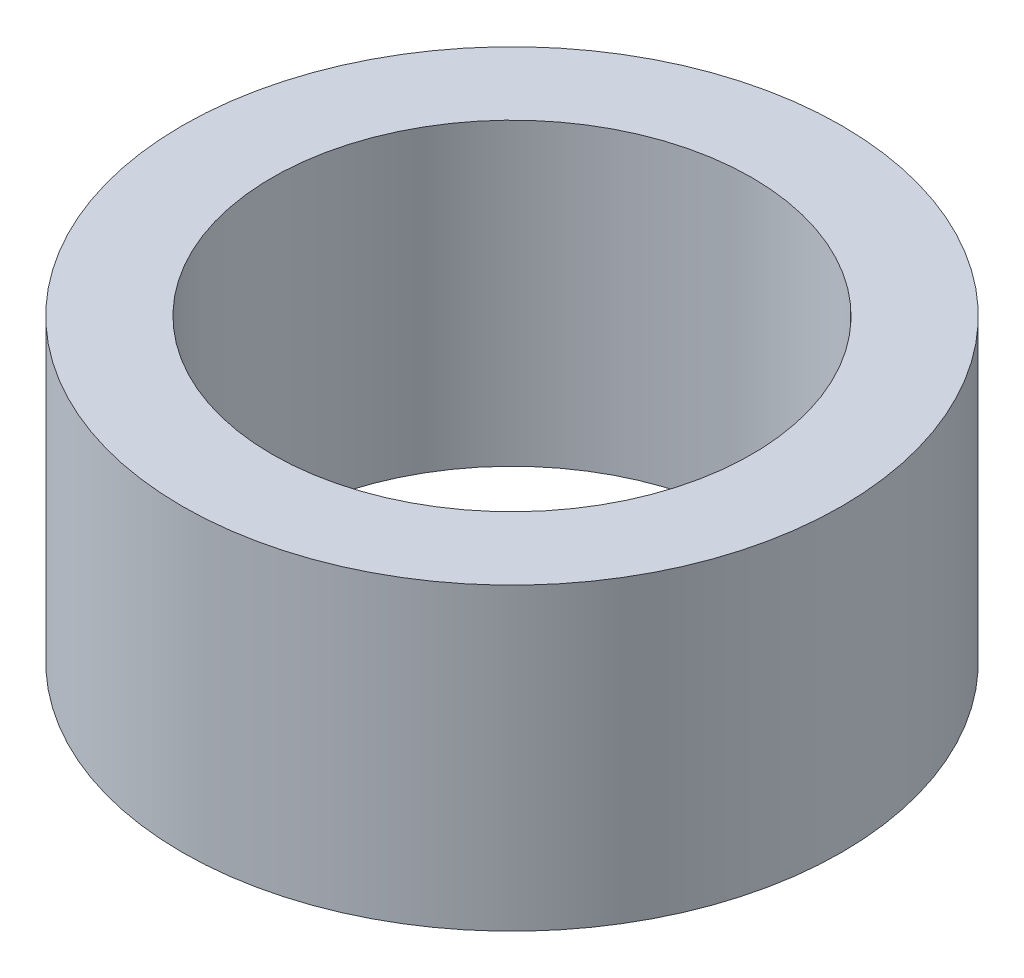
ISO-10303-21;
HEADER;
FILE_DESCRIPTION(('STEP AP214'),'2;1');
FILE_NAME('part.step','',(''),(''),'','','');
FILE_SCHEMA(('AUTOMOTIVE_DESIGN { 1 0 10303 214 1 1 1 1 }'));
ENDSEC;
DATA;
#1=APPLICATION_CONTEXT('core data for automotive mechanical design processes');
#2=APPLICATION_PROTOCOL_DEFINITION('international standard','automotive_design',2000,#1);
#3=PRODUCT_CONTEXT('',#1,'mechanical');
#4=PRODUCT('Part','Part','',(#3));
#5=PRODUCT_RELATED_PRODUCT_CATEGORY('part','',(#4));
#6=PRODUCT_DEFINITION_FORMATION('','',#4);
#7=PRODUCT_DEFINITION_CONTEXT('part definition',#1,'design');
#8=PRODUCT_DEFINITION('design','',#6,#7);
#9=PRODUCT_DEFINITION_SHAPE('','',#8);
#10=(LENGTH_UNIT() NAMED_UNIT(*) SI_UNIT(.MILLI.,.METRE.));
#11=(NAMED_UNIT(*) PLANE_ANGLE_UNIT() SI_UNIT($,.RADIAN.));
#12=(NAMED_UNIT(*) SI_UNIT($,.STERADIAN.) SOLID_ANGLE_UNIT());
#13=UNCERTAINTY_MEASURE_WITH_UNIT(LENGTH_MEASURE(1.E-05),#10,'distance_accuracy_value','');
#14=(GEOMETRIC_REPRESENTATION_CONTEXT(3) GLOBAL_UNCERTAINTY_ASSIGNED_CONTEXT((#13)) GLOBAL_UNIT_ASSIGNED_CONTEXT((#10,
#11,#12)) REPRESENTATION_CONTEXT('',''));
#15=CARTESIAN_POINT('',(0.,0.,0.));
#16=DIRECTION('',(0.,0.,1.));
#17=DIRECTION('',(1.,0.,0.));
#18=AXIS2_PLACEMENT_3D('',#15,#16,#17);
#19=CARTESIAN_POINT('',(0.,2.5,0.));
#20=DIRECTION('',(0.,1.,0.));
#21=DIRECTION('',(0.,0.,1.));
#22=AXIS2_PLACEMENT_3D('',#19,#20,#21);
#23=PLANE('',#22);
#24=CARTESIAN_POINT('',(0.,2.5,0.));
#25=DIRECTION('',(0.,1.,0.));
#26=DIRECTION('',(0.,0.,1.));
#27=AXIS2_PLACEMENT_3D('',#24,#25,#26);
#28=CIRCLE('',#27,5.5);
#29=CARTESIAN_POINT('',(0.,2.5,5.5));
#30=VERTEX_POINT('',#29);
#31=EDGE_CURVE('E10',#30,#30,#28,.T.);
#32=ORIENTED_EDGE('',*,*,#31,.T.);
#33=EDGE_LOOP('',(#32));
#34=FACE_BOUND('',#33,.T.);
#35=CARTESIAN_POINT('',(0.,2.5,0.));
#36=DIRECTION('',(0.,1.,0.));
#37=DIRECTION('',(0.,0.,1.));
#38=AXIS2_PLACEMENT_3D('',#35,#36,#37);
#39=CIRCLE('',#38,4.);
#40=CARTESIAN_POINT('',(0.,2.5,4.));
#41=VERTEX_POINT('',#40);
#42=EDGE_CURVE('E46',#41,#41,#39,.T.);
#43=ORIENTED_EDGE('',*,*,#42,.F.);
#44=EDGE_LOOP('',(#43));
#45=FACE_BOUND('',#44,.T.);
#46=ADVANCED_FACE('F35',(#34,#45),#23,.T.);
#47=CARTESIAN_POINT('',(0.,-2.5,0.));
#48=DIRECTION('',(0.,1.,0.));
#49=DIRECTION('',(0.,0.,1.));
#50=AXIS2_PLACEMENT_3D('',#47,#48,#49);
#51=PLANE('',#50);
#52=CARTESIAN_POINT('',(0.,-2.5,0.));
#53=DIRECTION('',(0.,1.,0.));
#54=DIRECTION('',(0.,0.,1.));
#55=AXIS2_PLACEMENT_3D('',#52,#53,#54);
#56=CIRCLE('',#55,5.5);
#57=CARTESIAN_POINT('',(0.,-2.5,5.5));
#58=VERTEX_POINT('',#57);
#59=EDGE_CURVE('E39',#58,#58,#56,.T.);
#60=ORIENTED_EDGE('',*,*,#59,.F.);
#61=EDGE_LOOP('',(#60));
#62=FACE_BOUND('',#61,.T.);
#63=CARTESIAN_POINT('',(0.,-2.5,0.));
#64=DIRECTION('',(0.,1.,0.));
#65=DIRECTION('',(0.,0.,1.));
#66=AXIS2_PLACEMENT_3D('',#63,#64,#65);
#67=CIRCLE('',#66,4.);
#68=CARTESIAN_POINT('',(0.,-2.5,4.));
#69=VERTEX_POINT('',#68);
#70=EDGE_CURVE('E48',#69,#69,#67,.T.);
#71=ORIENTED_EDGE('',*,*,#70,.T.);
#72=EDGE_LOOP('',(#71));
#73=FACE_BOUND('',#72,.T.);
#74=ADVANCED_FACE('F58',(#62,#73),#51,.F.);
#75=CARTESIAN_POINT('',(0.,2.5,0.));
#76=DIRECTION('',(0.,-1.,0.));
#77=DIRECTION('',(0.,0.,-1.));
#78=AXIS2_PLACEMENT_3D('',#75,#76,#77);
#79=CYLINDRICAL_SURFACE('',#78,5.5);
#80=ORIENTED_EDGE('',*,*,#31,.F.);
#81=EDGE_LOOP('',(#80));
#82=FACE_BOUND('',#81,.T.);
#83=ORIENTED_EDGE('',*,*,#59,.T.);
#84=EDGE_LOOP('',(#83));
#85=FACE_BOUND('',#84,.T.);
#86=ADVANCED_FACE('F37',(#82,#85),#79,.T.);
#87=CARTESIAN_POINT('',(0.,2.5,0.));
#88=DIRECTION('',(0.,-1.,0.));
#89=DIRECTION('',(0.,0.,-1.));
#90=AXIS2_PLACEMENT_3D('',#87,#88,#89);
#91=CYLINDRICAL_SURFACE('',#90,4.);
#92=ORIENTED_EDGE('',*,*,#42,.T.);
#93=EDGE_LOOP('',(#92));
#94=FACE_BOUND('',#93,.T.);
#95=ORIENTED_EDGE('',*,*,#70,.F.);
#96=EDGE_LOOP('',(#95));
#97=FACE_BOUND('',#96,.T.);
#98=ADVANCED_FACE('F54',(#94,#97),#91,.F.);
#99=CLOSED_SHELL('',(#46,#74,#86,#98));
#100=MANIFOLD_SOLID_BREP('B2',#99);
#101=ADVANCED_BREP_SHAPE_REPRESENTATION('',(#18,#100),#14);
#102=SHAPE_DEFINITION_REPRESENTATION(#9,#101);
ENDSEC;
END-ISO-10303-21;
